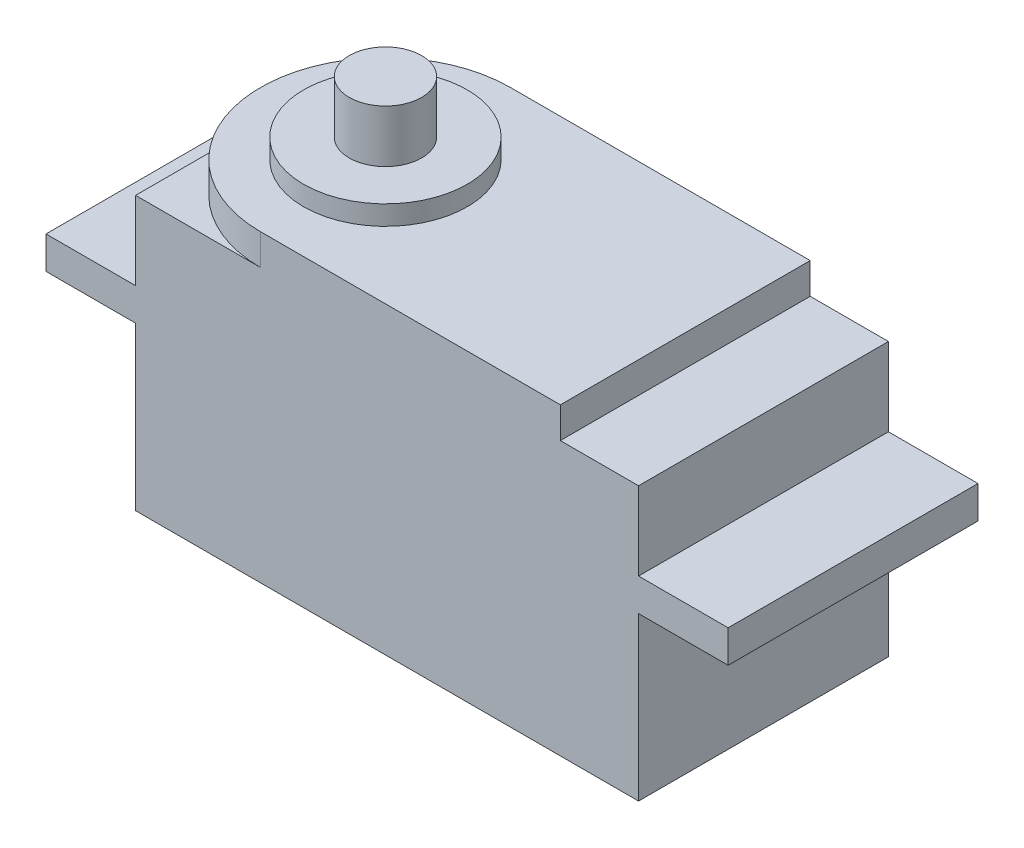
ISO-10303-21;
HEADER;
FILE_DESCRIPTION(('STEP AP214'),'2;1');
FILE_NAME('part.step','',(''),(''),'','','');
FILE_SCHEMA(('AUTOMOTIVE_DESIGN { 1 0 10303 214 1 1 1 1 }'));
ENDSEC;
DATA;
#1=APPLICATION_CONTEXT('core data for automotive mechanical design processes');
#2=APPLICATION_PROTOCOL_DEFINITION('international standard','automotive_design',2000,#1);
#3=PRODUCT_CONTEXT('',#1,'mechanical');
#4=PRODUCT('Part','Part','',(#3));
#5=PRODUCT_RELATED_PRODUCT_CATEGORY('part','',(#4));
#6=PRODUCT_DEFINITION_FORMATION('','',#4);
#7=PRODUCT_DEFINITION_CONTEXT('part definition',#1,'design');
#8=PRODUCT_DEFINITION('design','',#6,#7);
#9=PRODUCT_DEFINITION_SHAPE('','',#8);
#10=(LENGTH_UNIT() NAMED_UNIT(*) SI_UNIT(.MILLI.,.METRE.));
#11=(NAMED_UNIT(*) PLANE_ANGLE_UNIT() SI_UNIT($,.RADIAN.));
#12=(NAMED_UNIT(*) SI_UNIT($,.STERADIAN.) SOLID_ANGLE_UNIT());
#13=UNCERTAINTY_MEASURE_WITH_UNIT(LENGTH_MEASURE(1.E-05),#10,'distance_accuracy_value','');
#14=(GEOMETRIC_REPRESENTATION_CONTEXT(3) GLOBAL_UNCERTAINTY_ASSIGNED_CONTEXT((#13)) GLOBAL_UNIT_ASSIGNED_CONTEXT((#10,
#11,#12)) REPRESENTATION_CONTEXT('',''));
#15=CARTESIAN_POINT('',(0.,0.,0.));
#16=DIRECTION('',(0.,0.,1.));
#17=DIRECTION('',(1.,0.,0.));
#18=AXIS2_PLACEMENT_3D('',#15,#16,#17);
#19=CARTESIAN_POINT('',(-20.13,36.86,10.));
#20=DIRECTION('',(1.,0.,0.));
#21=DIRECTION('',(0.,0.,-1.));
#22=AXIS2_PLACEMENT_3D('',#19,#20,#21);
#23=PLANE('',#22);
#24=DIRECTION('',(0.,0.,-1.));
#25=VECTOR('',#24,1.);
#26=CARTESIAN_POINT('',(-20.13,15.,10.));
#27=LINE('',#26,#25);
#28=CARTESIAN_POINT('',(-20.13,15.,10.));
#29=VERTEX_POINT('',#28);
#30=CARTESIAN_POINT('',(-20.13,15.,-10.));
#31=VERTEX_POINT('',#30);
#32=EDGE_CURVE('E156',#29,#31,#27,.T.);
#33=ORIENTED_EDGE('',*,*,#32,.F.);
#34=DIRECTION('',(0.,-1.,0.));
#35=VECTOR('',#34,1.);
#36=CARTESIAN_POINT('',(-20.13,36.86,10.));
#37=LINE('',#36,#35);
#38=CARTESIAN_POINT('',(-20.13,28.,10.));
#39=VERTEX_POINT('',#38);
#40=EDGE_CURVE('E196',#39,#29,#37,.T.);
#41=ORIENTED_EDGE('',*,*,#40,.F.);
#42=DIRECTION('',(0.,0.,1.));
#43=VECTOR('',#42,1.);
#44=CARTESIAN_POINT('',(-20.13,28.,-10.));
#45=LINE('',#44,#43);
#46=CARTESIAN_POINT('',(-20.13,28.,-10.));
#47=VERTEX_POINT('',#46);
#48=EDGE_CURVE('E253',#47,#39,#45,.T.);
#49=ORIENTED_EDGE('',*,*,#48,.F.);
#50=DIRECTION('',(0.,-1.,0.));
#51=VECTOR('',#50,1.);
#52=CARTESIAN_POINT('',(-20.13,36.86,-10.));
#53=LINE('',#52,#51);
#54=EDGE_CURVE('E179',#47,#31,#53,.T.);
#55=ORIENTED_EDGE('',*,*,#54,.T.);
#56=EDGE_LOOP('',(#33,#41,#49,#55));
#57=FACE_BOUND('',#56,.T.);
#58=ADVANCED_FACE('F36',(#57),#23,.F.);
#59=CARTESIAN_POINT('',(20.13,36.86,10.));
#60=DIRECTION('',(-1.,0.,0.));
#61=DIRECTION('',(0.,0.,1.));
#62=AXIS2_PLACEMENT_3D('',#59,#60,#61);
#63=PLANE('',#62);
#64=DIRECTION('',(0.,0.,1.));
#65=VECTOR('',#64,1.);
#66=CARTESIAN_POINT('',(20.13,15.,-10.));
#67=LINE('',#66,#65);
#68=CARTESIAN_POINT('',(20.13,15.,-10.));
#69=VERTEX_POINT('',#68);
#70=CARTESIAN_POINT('',(20.13,15.,10.));
#71=VERTEX_POINT('',#70);
#72=EDGE_CURVE('E53',#69,#71,#67,.T.);
#73=ORIENTED_EDGE('',*,*,#72,.F.);
#74=DIRECTION('',(0.,-1.,0.));
#75=VECTOR('',#74,1.);
#76=CARTESIAN_POINT('',(20.13,36.86,-10.));
#77=LINE('',#76,#75);
#78=CARTESIAN_POINT('',(20.13,28.,-10.));
#79=VERTEX_POINT('',#78);
#80=EDGE_CURVE('E164',#79,#69,#77,.T.);
#81=ORIENTED_EDGE('',*,*,#80,.F.);
#82=DIRECTION('',(0.,0.,-1.));
#83=VECTOR('',#82,1.);
#84=CARTESIAN_POINT('',(20.13,28.,10.));
#85=LINE('',#84,#83);
#86=CARTESIAN_POINT('',(20.13,28.,10.));
#87=VERTEX_POINT('',#86);
#88=EDGE_CURVE('E212',#87,#79,#85,.T.);
#89=ORIENTED_EDGE('',*,*,#88,.F.);
#90=DIRECTION('',(0.,-1.,0.));
#91=VECTOR('',#90,1.);
#92=CARTESIAN_POINT('',(20.13,36.86,10.));
#93=LINE('',#92,#91);
#94=EDGE_CURVE('E167',#87,#71,#93,.T.);
#95=ORIENTED_EDGE('',*,*,#94,.T.);
#96=EDGE_LOOP('',(#73,#81,#89,#95));
#97=FACE_BOUND('',#96,.T.);
#98=ADVANCED_FACE('F38',(#97),#63,.F.);
#99=CARTESIAN_POINT('',(-20.13,36.86,-10.));
#100=DIRECTION('',(0.,0.,1.));
#101=DIRECTION('',(1.,0.,0.));
#102=AXIS2_PLACEMENT_3D('',#99,#100,#101);
#103=PLANE('',#102);
#104=DIRECTION('',(1.,0.,0.));
#105=VECTOR('',#104,1.);
#106=CARTESIAN_POINT('',(-20.13,15.,-10.));
#107=LINE('',#106,#105);
#108=EDGE_CURVE('E153',#31,#69,#107,.T.);
#109=ORIENTED_EDGE('',*,*,#108,.F.);
#110=ORIENTED_EDGE('',*,*,#54,.F.);
#111=DIRECTION('',(1.,0.,0.));
#112=VECTOR('',#111,1.);
#113=CARTESIAN_POINT('',(-27.3,28.,-10.));
#114=LINE('',#113,#112);
#115=CARTESIAN_POINT('',(-27.3,28.,-10.));
#116=VERTEX_POINT('',#115);
#117=EDGE_CURVE('E243',#116,#47,#114,.T.);
#118=ORIENTED_EDGE('',*,*,#117,.F.);
#119=DIRECTION('',(0.,-1.,0.));
#120=VECTOR('',#119,1.);
#121=CARTESIAN_POINT('',(-27.3,28.,-10.));
#122=LINE('',#121,#120);
#123=CARTESIAN_POINT('',(-27.3,30.6,-10.));
#124=VERTEX_POINT('',#123);
#125=EDGE_CURVE('E380',#124,#116,#122,.T.);
#126=ORIENTED_EDGE('',*,*,#125,.F.);
#127=DIRECTION('',(1.,0.,0.));
#128=VECTOR('',#127,1.);
#129=CARTESIAN_POINT('',(-27.3,30.6,-10.));
#130=LINE('',#129,#128);
#131=CARTESIAN_POINT('',(-20.13,30.6,-10.));
#132=VERTEX_POINT('',#131);
#133=EDGE_CURVE('E246',#124,#132,#130,.T.);
#134=ORIENTED_EDGE('',*,*,#133,.T.);
#135=CARTESIAN_POINT('',(-20.13,36.86,-10.));
#136=VERTEX_POINT('',#135);
#137=EDGE_CURVE('E175',#136,#132,#53,.T.);
#138=ORIENTED_EDGE('',*,*,#137,.F.);
#139=DIRECTION('',(-1.,0.,0.));
#140=VECTOR('',#139,1.);
#141=CARTESIAN_POINT('',(-20.13,36.86,-10.));
#142=LINE('',#141,#140);
#143=CARTESIAN_POINT('',(-10.13,36.86,-10.));
#144=VERTEX_POINT('',#143);
#145=EDGE_CURVE('E227',#144,#136,#142,.T.);
#146=ORIENTED_EDGE('',*,*,#145,.F.);
#147=DIRECTION('',(0.,-1.,0.));
#148=VECTOR('',#147,1.);
#149=CARTESIAN_POINT('',(-10.13,39.34,-10.));
#150=LINE('',#149,#148);
#151=CARTESIAN_POINT('',(-10.13,39.34,-10.));
#152=VERTEX_POINT('',#151);
#153=EDGE_CURVE('E348',#152,#144,#150,.T.);
#154=ORIENTED_EDGE('',*,*,#153,.F.);
#155=DIRECTION('',(-1.,0.,0.));
#156=VECTOR('',#155,1.);
#157=CARTESIAN_POINT('',(0.,39.34,-10.));
#158=LINE('',#157,#156);
#159=CARTESIAN_POINT('',(13.87,39.34,-10.));
#160=VERTEX_POINT('',#159);
#161=EDGE_CURVE('E337',#160,#152,#158,.T.);
#162=ORIENTED_EDGE('',*,*,#161,.F.);
#163=DIRECTION('',(0.,-1.,0.));
#164=VECTOR('',#163,1.);
#165=CARTESIAN_POINT('',(13.87,39.34,-10.));
#166=LINE('',#165,#164);
#167=CARTESIAN_POINT('',(13.87,36.86,-10.));
#168=VERTEX_POINT('',#167);
#169=EDGE_CURVE('E324',#160,#168,#166,.T.);
#170=ORIENTED_EDGE('',*,*,#169,.T.);
#171=CARTESIAN_POINT('',(20.13,36.86,-10.));
#172=VERTEX_POINT('',#171);
#173=EDGE_CURVE('E237',#172,#168,#142,.T.);
#174=ORIENTED_EDGE('',*,*,#173,.F.);
#175=CARTESIAN_POINT('',(20.13,30.6,-10.));
#176=VERTEX_POINT('',#175);
#177=EDGE_CURVE('E45',#172,#176,#77,.T.);
#178=ORIENTED_EDGE('',*,*,#177,.T.);
#179=DIRECTION('',(-1.,0.,0.));
#180=VECTOR('',#179,1.);
#181=CARTESIAN_POINT('',(27.3,30.6,-10.));
#182=LINE('',#181,#180);
#183=CARTESIAN_POINT('',(27.3,30.6,-10.));
#184=VERTEX_POINT('',#183);
#185=EDGE_CURVE('E228',#184,#176,#182,.T.);
#186=ORIENTED_EDGE('',*,*,#185,.F.);
#187=DIRECTION('',(0.,1.,0.));
#188=VECTOR('',#187,1.);
#189=CARTESIAN_POINT('',(27.3,28.,-10.));
#190=LINE('',#189,#188);
#191=CARTESIAN_POINT('',(27.3,28.,-10.));
#192=VERTEX_POINT('',#191);
#193=EDGE_CURVE('E215',#192,#184,#190,.T.);
#194=ORIENTED_EDGE('',*,*,#193,.F.);
#195=DIRECTION('',(-1.,0.,0.));
#196=VECTOR('',#195,1.);
#197=CARTESIAN_POINT('',(27.3,28.,-10.));
#198=LINE('',#197,#196);
#199=EDGE_CURVE('E174',#192,#79,#198,.T.);
#200=ORIENTED_EDGE('',*,*,#199,.T.);
#201=ORIENTED_EDGE('',*,*,#80,.T.);
#202=EDGE_LOOP('',(#109,#110,#118,#126,#134,#138,#146,#154,#162,#170,#174,#178,#186,#194,#200,#201));
#203=FACE_BOUND('',#202,.T.);
#204=ADVANCED_FACE('F171',(#203),#103,.F.);
#205=CARTESIAN_POINT('',(-20.13,36.86,10.));
#206=DIRECTION('',(0.,0.,-1.));
#207=DIRECTION('',(-1.,0.,0.));
#208=AXIS2_PLACEMENT_3D('',#205,#206,#207);
#209=PLANE('',#208);
#210=DIRECTION('',(-1.,0.,0.));
#211=VECTOR('',#210,1.);
#212=CARTESIAN_POINT('',(20.13,15.,10.));
#213=LINE('',#212,#211);
#214=EDGE_CURVE('E168',#71,#29,#213,.T.);
#215=ORIENTED_EDGE('',*,*,#214,.F.);
#216=ORIENTED_EDGE('',*,*,#94,.F.);
#217=DIRECTION('',(-1.,0.,0.));
#218=VECTOR('',#217,1.);
#219=CARTESIAN_POINT('',(27.3,28.,10.));
#220=LINE('',#219,#218);
#221=CARTESIAN_POINT('',(27.3,28.,10.));
#222=VERTEX_POINT('',#221);
#223=EDGE_CURVE('E204',#222,#87,#220,.T.);
#224=ORIENTED_EDGE('',*,*,#223,.F.);
#225=DIRECTION('',(0.,-1.,0.));
#226=VECTOR('',#225,1.);
#227=CARTESIAN_POINT('',(27.3,28.,10.));
#228=LINE('',#227,#226);
#229=CARTESIAN_POINT('',(27.3,30.6,10.));
#230=VERTEX_POINT('',#229);
#231=EDGE_CURVE('E270',#230,#222,#228,.T.);
#232=ORIENTED_EDGE('',*,*,#231,.F.);
#233=DIRECTION('',(-1.,0.,0.));
#234=VECTOR('',#233,1.);
#235=CARTESIAN_POINT('',(27.3,30.6,10.));
#236=LINE('',#235,#234);
#237=CARTESIAN_POINT('',(20.13,30.6,10.));
#238=VERTEX_POINT('',#237);
#239=EDGE_CURVE('E207',#230,#238,#236,.T.);
#240=ORIENTED_EDGE('',*,*,#239,.T.);
#241=CARTESIAN_POINT('',(20.13,36.86,10.));
#242=VERTEX_POINT('',#241);
#243=EDGE_CURVE('E183',#242,#238,#93,.T.);
#244=ORIENTED_EDGE('',*,*,#243,.F.);
#245=DIRECTION('',(1.,0.,0.));
#246=VECTOR('',#245,1.);
#247=CARTESIAN_POINT('',(-20.13,36.86,10.));
#248=LINE('',#247,#246);
#249=CARTESIAN_POINT('',(13.87,36.86,10.));
#250=VERTEX_POINT('',#249);
#251=EDGE_CURVE('E295',#250,#242,#248,.T.);
#252=ORIENTED_EDGE('',*,*,#251,.F.);
#253=DIRECTION('',(0.,-1.,0.));
#254=VECTOR('',#253,1.);
#255=CARTESIAN_POINT('',(13.87,39.34,10.));
#256=LINE('',#255,#254);
#257=CARTESIAN_POINT('',(13.87,39.34,10.));
#258=VERTEX_POINT('',#257);
#259=EDGE_CURVE('E61',#258,#250,#256,.T.);
#260=ORIENTED_EDGE('',*,*,#259,.F.);
#261=DIRECTION('',(1.,0.,0.));
#262=VECTOR('',#261,1.);
#263=CARTESIAN_POINT('',(0.,39.34,10.));
#264=LINE('',#263,#262);
#265=CARTESIAN_POINT('',(-10.13,39.34,10.));
#266=VERTEX_POINT('',#265);
#267=EDGE_CURVE('E320',#266,#258,#264,.T.);
#268=ORIENTED_EDGE('',*,*,#267,.F.);
#269=DIRECTION('',(0.,-1.,0.));
#270=VECTOR('',#269,1.);
#271=CARTESIAN_POINT('',(-10.13,39.34,10.));
#272=LINE('',#271,#270);
#273=CARTESIAN_POINT('',(-10.13,36.86,10.));
#274=VERTEX_POINT('',#273);
#275=EDGE_CURVE('E319',#266,#274,#272,.T.);
#276=ORIENTED_EDGE('',*,*,#275,.T.);
#277=CARTESIAN_POINT('',(-20.13,36.86,10.));
#278=VERTEX_POINT('',#277);
#279=EDGE_CURVE('E289',#278,#274,#248,.T.);
#280=ORIENTED_EDGE('',*,*,#279,.F.);
#281=CARTESIAN_POINT('',(-20.13,30.6,10.));
#282=VERTEX_POINT('',#281);
#283=EDGE_CURVE('E199',#278,#282,#37,.T.);
#284=ORIENTED_EDGE('',*,*,#283,.T.);
#285=DIRECTION('',(1.,0.,0.));
#286=VECTOR('',#285,1.);
#287=CARTESIAN_POINT('',(-27.3,30.6,10.));
#288=LINE('',#287,#286);
#289=CARTESIAN_POINT('',(-27.3,30.6,10.));
#290=VERTEX_POINT('',#289);
#291=EDGE_CURVE('E288',#290,#282,#288,.T.);
#292=ORIENTED_EDGE('',*,*,#291,.F.);
#293=DIRECTION('',(0.,1.,0.));
#294=VECTOR('',#293,1.);
#295=CARTESIAN_POINT('',(-27.3,28.,10.));
#296=LINE('',#295,#294);
#297=CARTESIAN_POINT('',(-27.3,28.,10.));
#298=VERTEX_POINT('',#297);
#299=EDGE_CURVE('E257',#298,#290,#296,.T.);
#300=ORIENTED_EDGE('',*,*,#299,.F.);
#301=DIRECTION('',(1.,0.,0.));
#302=VECTOR('',#301,1.);
#303=CARTESIAN_POINT('',(-27.3,28.,10.));
#304=LINE('',#303,#302);
#305=EDGE_CURVE('E247',#298,#39,#304,.T.);
#306=ORIENTED_EDGE('',*,*,#305,.T.);
#307=ORIENTED_EDGE('',*,*,#40,.T.);
#308=EDGE_LOOP('',(#215,#216,#224,#232,#240,#244,#252,#260,#268,#276,#280,#284,#292,#300,#306,#307));
#309=FACE_BOUND('',#308,.T.);
#310=ADVANCED_FACE('F317',(#309),#209,.F.);
#311=CARTESIAN_POINT('',(-10.13,40.9,0.));
#312=DIRECTION('',(0.,1.,0.));
#313=DIRECTION('',(0.,0.,1.));
#314=AXIS2_PLACEMENT_3D('',#311,#312,#313);
#315=PLANE('',#314);
#316=CARTESIAN_POINT('',(-10.13,40.9,0.));
#317=DIRECTION('',(0.,1.,0.));
#318=DIRECTION('',(0.,0.,1.));
#319=AXIS2_PLACEMENT_3D('',#316,#317,#318);
#320=CIRCLE('',#319,6.55);
#321=CARTESIAN_POINT('',(-10.13,40.9,6.55));
#322=VERTEX_POINT('',#321);
#323=EDGE_CURVE('E331',#322,#322,#320,.T.);
#324=ORIENTED_EDGE('',*,*,#323,.T.);
#325=EDGE_LOOP('',(#324));
#326=FACE_BOUND('',#325,.T.);
#327=CARTESIAN_POINT('',(-10.13,40.9,0.));
#328=DIRECTION('',(0.,1.,0.));
#329=DIRECTION('',(0.,0.,1.));
#330=AXIS2_PLACEMENT_3D('',#327,#328,#329);
#331=CIRCLE('',#330,2.9);
#332=CARTESIAN_POINT('',(-10.13,40.9,2.9));
#333=VERTEX_POINT('',#332);
#334=EDGE_CURVE('E364',#333,#333,#331,.T.);
#335=ORIENTED_EDGE('',*,*,#334,.F.);
#336=EDGE_LOOP('',(#335));
#337=FACE_BOUND('',#336,.T.);
#338=ADVANCED_FACE('F523',(#326,#337),#315,.T.);
#339=CARTESIAN_POINT('',(0.,39.34,0.));
#340=DIRECTION('',(0.,1.,0.));
#341=DIRECTION('',(0.,0.,1.));
#342=AXIS2_PLACEMENT_3D('',#339,#340,#341);
#343=PLANE('',#342);
#344=CARTESIAN_POINT('',(-10.13,39.34,0.));
#345=DIRECTION('',(0.,1.,0.));
#346=DIRECTION('',(0.,0.,1.));
#347=AXIS2_PLACEMENT_3D('',#344,#345,#346);
#348=CIRCLE('',#347,10.);
#349=EDGE_CURVE('E343',#152,#266,#348,.T.);
#350=ORIENTED_EDGE('',*,*,#349,.T.);
#351=ORIENTED_EDGE('',*,*,#267,.T.);
#352=DIRECTION('',(0.,0.,1.));
#353=VECTOR('',#352,1.);
#354=CARTESIAN_POINT('',(13.87,39.34,0.));
#355=LINE('',#354,#353);
#356=EDGE_CURVE('E351',#160,#258,#355,.T.);
#357=ORIENTED_EDGE('',*,*,#356,.F.);
#358=ORIENTED_EDGE('',*,*,#161,.T.);
#359=EDGE_LOOP('',(#350,#351,#357,#358));
#360=FACE_BOUND('',#359,.T.);
#361=CARTESIAN_POINT('',(-10.13,39.34,0.));
#362=DIRECTION('',(0.,1.,0.));
#363=DIRECTION('',(0.,0.,1.));
#364=AXIS2_PLACEMENT_3D('',#361,#362,#363);
#365=CIRCLE('',#364,6.55);
#366=CARTESIAN_POINT('',(-10.13,39.34,6.55));
#367=VERTEX_POINT('',#366);
#368=EDGE_CURVE('E358',#367,#367,#365,.T.);
#369=ORIENTED_EDGE('',*,*,#368,.F.);
#370=EDGE_LOOP('',(#369));
#371=FACE_BOUND('',#370,.T.);
#372=ADVANCED_FACE('F420',(#360,#371),#343,.T.);
#373=CARTESIAN_POINT('',(0.,36.86,0.));
#374=DIRECTION('',(0.,-1.,0.));
#375=DIRECTION('',(0.,0.,-1.));
#376=AXIS2_PLACEMENT_3D('',#373,#374,#375);
#377=PLANE('',#376);
#378=CARTESIAN_POINT('',(-10.13,36.86,0.));
#379=DIRECTION('',(0.,1.,0.));
#380=DIRECTION('',(0.,0.,1.));
#381=AXIS2_PLACEMENT_3D('',#378,#379,#380);
#382=CIRCLE('',#381,10.);
#383=CARTESIAN_POINT('',(-20.13,36.86,0.));
#384=VERTEX_POINT('',#383);
#385=EDGE_CURVE('E327',#144,#384,#382,.T.);
#386=ORIENTED_EDGE('',*,*,#385,.F.);
#387=ORIENTED_EDGE('',*,*,#145,.T.);
#388=DIRECTION('',(0.,0.,1.));
#389=VECTOR('',#388,1.);
#390=CARTESIAN_POINT('',(-20.13,36.86,10.));
#391=LINE('',#390,#389);
#392=EDGE_CURVE('E231',#136,#384,#391,.T.);
#393=ORIENTED_EDGE('',*,*,#392,.T.);
#394=EDGE_LOOP('',(#386,#387,#393));
#395=FACE_BOUND('',#394,.T.);
#396=ADVANCED_FACE('F415',(#395),#377,.F.);
#397=EDGE_CURVE('E11',#384,#274,#382,.T.);
#398=ORIENTED_EDGE('',*,*,#397,.F.);
#399=EDGE_CURVE('E240',#384,#278,#391,.T.);
#400=ORIENTED_EDGE('',*,*,#399,.T.);
#401=ORIENTED_EDGE('',*,*,#279,.T.);
#402=EDGE_LOOP('',(#398,#400,#401));
#403=FACE_BOUND('',#402,.T.);
#404=ADVANCED_FACE('F309',(#403),#377,.F.);
#405=DIRECTION('',(0.,0.,-1.));
#406=VECTOR('',#405,1.);
#407=CARTESIAN_POINT('',(-20.13,30.6,-10.));
#408=LINE('',#407,#406);
#409=EDGE_CURVE('E258',#282,#132,#408,.T.);
#410=ORIENTED_EDGE('',*,*,#409,.F.);
#411=ORIENTED_EDGE('',*,*,#283,.F.);
#412=ORIENTED_EDGE('',*,*,#399,.F.);
#413=ORIENTED_EDGE('',*,*,#392,.F.);
#414=ORIENTED_EDGE('',*,*,#137,.T.);
#415=EDGE_LOOP('',(#410,#411,#412,#413,#414));
#416=FACE_BOUND('',#415,.T.);
#417=ADVANCED_FACE('F311',(#416),#23,.F.);
#418=DIRECTION('',(0.,0.,1.));
#419=VECTOR('',#418,1.);
#420=CARTESIAN_POINT('',(20.13,30.6,10.));
#421=LINE('',#420,#419);
#422=EDGE_CURVE('E216',#176,#238,#421,.T.);
#423=ORIENTED_EDGE('',*,*,#422,.F.);
#424=ORIENTED_EDGE('',*,*,#177,.F.);
#425=DIRECTION('',(0.,0.,-1.));
#426=VECTOR('',#425,1.);
#427=CARTESIAN_POINT('',(20.13,36.86,10.));
#428=LINE('',#427,#426);
#429=EDGE_CURVE('E224',#242,#172,#428,.T.);
#430=ORIENTED_EDGE('',*,*,#429,.F.);
#431=ORIENTED_EDGE('',*,*,#243,.T.);
#432=EDGE_LOOP('',(#423,#424,#430,#431));
#433=FACE_BOUND('',#432,.T.);
#434=ADVANCED_FACE('F406',(#433),#63,.F.);
#435=ORIENTED_EDGE('',*,*,#173,.T.);
#436=DIRECTION('',(0.,0.,1.));
#437=VECTOR('',#436,1.);
#438=CARTESIAN_POINT('',(13.87,36.86,0.));
#439=LINE('',#438,#437);
#440=EDGE_CURVE('E330',#168,#250,#439,.T.);
#441=ORIENTED_EDGE('',*,*,#440,.T.);
#442=ORIENTED_EDGE('',*,*,#251,.T.);
#443=ORIENTED_EDGE('',*,*,#429,.T.);
#444=EDGE_LOOP('',(#435,#441,#442,#443));
#445=FACE_BOUND('',#444,.T.);
#446=ADVANCED_FACE('F413',(#445),#377,.F.);
#447=CARTESIAN_POINT('',(27.3,30.6,10.));
#448=DIRECTION('',(0.,-1.,0.));
#449=DIRECTION('',(0.,0.,-1.));
#450=AXIS2_PLACEMENT_3D('',#447,#448,#449);
#451=PLANE('',#450);
#452=ORIENTED_EDGE('',*,*,#422,.T.);
#453=ORIENTED_EDGE('',*,*,#239,.F.);
#454=DIRECTION('',(0.,0.,1.));
#455=VECTOR('',#454,1.);
#456=CARTESIAN_POINT('',(27.3,30.6,10.));
#457=LINE('',#456,#455);
#458=EDGE_CURVE('E268',#184,#230,#457,.T.);
#459=ORIENTED_EDGE('',*,*,#458,.F.);
#460=ORIENTED_EDGE('',*,*,#185,.T.);
#461=EDGE_LOOP('',(#452,#453,#459,#460));
#462=FACE_BOUND('',#461,.T.);
#463=ADVANCED_FACE('F423',(#462),#451,.F.);
#464=CARTESIAN_POINT('',(27.3,28.,10.));
#465=DIRECTION('',(0.,1.,0.));
#466=DIRECTION('',(0.,0.,1.));
#467=AXIS2_PLACEMENT_3D('',#464,#465,#466);
#468=PLANE('',#467);
#469=ORIENTED_EDGE('',*,*,#88,.T.);
#470=ORIENTED_EDGE('',*,*,#199,.F.);
#471=DIRECTION('',(0.,0.,-1.));
#472=VECTOR('',#471,1.);
#473=CARTESIAN_POINT('',(27.3,28.,10.));
#474=LINE('',#473,#472);
#475=EDGE_CURVE('E211',#222,#192,#474,.T.);
#476=ORIENTED_EDGE('',*,*,#475,.F.);
#477=ORIENTED_EDGE('',*,*,#223,.T.);
#478=EDGE_LOOP('',(#469,#470,#476,#477));
#479=FACE_BOUND('',#478,.T.);
#480=ADVANCED_FACE('F278',(#479),#468,.F.);
#481=CARTESIAN_POINT('',(27.3,0.,0.));
#482=DIRECTION('',(-1.,0.,0.));
#483=DIRECTION('',(0.,0.,1.));
#484=AXIS2_PLACEMENT_3D('',#481,#482,#483);
#485=PLANE('',#484);
#486=ORIENTED_EDGE('',*,*,#193,.T.);
#487=ORIENTED_EDGE('',*,*,#458,.T.);
#488=ORIENTED_EDGE('',*,*,#231,.T.);
#489=ORIENTED_EDGE('',*,*,#475,.T.);
#490=EDGE_LOOP('',(#486,#487,#488,#489));
#491=FACE_BOUND('',#490,.T.);
#492=ADVANCED_FACE('F273',(#491),#485,.F.);
#493=CARTESIAN_POINT('',(-27.3,30.6,-10.));
#494=DIRECTION('',(0.,-1.,0.));
#495=DIRECTION('',(0.,0.,-1.));
#496=AXIS2_PLACEMENT_3D('',#493,#494,#495);
#497=PLANE('',#496);
#498=ORIENTED_EDGE('',*,*,#409,.T.);
#499=ORIENTED_EDGE('',*,*,#133,.F.);
#500=DIRECTION('',(0.,0.,-1.));
#501=VECTOR('',#500,1.);
#502=CARTESIAN_POINT('',(-27.3,30.6,-10.));
#503=LINE('',#502,#501);
#504=EDGE_CURVE('E384',#290,#124,#503,.T.);
#505=ORIENTED_EDGE('',*,*,#504,.F.);
#506=ORIENTED_EDGE('',*,*,#291,.T.);
#507=EDGE_LOOP('',(#498,#499,#505,#506));
#508=FACE_BOUND('',#507,.T.);
#509=ADVANCED_FACE('F392',(#508),#497,.F.);
#510=CARTESIAN_POINT('',(-27.3,28.,-10.));
#511=DIRECTION('',(0.,1.,0.));
#512=DIRECTION('',(0.,0.,1.));
#513=AXIS2_PLACEMENT_3D('',#510,#511,#512);
#514=PLANE('',#513);
#515=ORIENTED_EDGE('',*,*,#48,.T.);
#516=ORIENTED_EDGE('',*,*,#305,.F.);
#517=DIRECTION('',(0.,0.,1.));
#518=VECTOR('',#517,1.);
#519=CARTESIAN_POINT('',(-27.3,28.,-10.));
#520=LINE('',#519,#518);
#521=EDGE_CURVE('E252',#116,#298,#520,.T.);
#522=ORIENTED_EDGE('',*,*,#521,.F.);
#523=ORIENTED_EDGE('',*,*,#117,.T.);
#524=EDGE_LOOP('',(#515,#516,#522,#523));
#525=FACE_BOUND('',#524,.T.);
#526=ADVANCED_FACE('F376',(#525),#514,.F.);
#527=CARTESIAN_POINT('',(-27.3,0.,0.));
#528=DIRECTION('',(1.,0.,0.));
#529=DIRECTION('',(0.,0.,-1.));
#530=AXIS2_PLACEMENT_3D('',#527,#528,#529);
#531=PLANE('',#530);
#532=ORIENTED_EDGE('',*,*,#299,.T.);
#533=ORIENTED_EDGE('',*,*,#504,.T.);
#534=ORIENTED_EDGE('',*,*,#125,.T.);
#535=ORIENTED_EDGE('',*,*,#521,.T.);
#536=EDGE_LOOP('',(#532,#533,#534,#535));
#537=FACE_BOUND('',#536,.T.);
#538=ADVANCED_FACE('F387',(#537),#531,.F.);
#539=CARTESIAN_POINT('',(-10.13,39.34,0.));
#540=DIRECTION('',(0.,-1.,0.));
#541=DIRECTION('',(0.,0.,-1.));
#542=AXIS2_PLACEMENT_3D('',#539,#540,#541);
#543=CYLINDRICAL_SURFACE('',#542,10.);
#544=ORIENTED_EDGE('',*,*,#385,.T.);
#545=ORIENTED_EDGE('',*,*,#397,.T.);
#546=ORIENTED_EDGE('',*,*,#275,.F.);
#547=ORIENTED_EDGE('',*,*,#349,.F.);
#548=ORIENTED_EDGE('',*,*,#153,.T.);
#549=EDGE_LOOP('',(#544,#545,#546,#547,#548));
#550=FACE_BOUND('',#549,.T.);
#551=ADVANCED_FACE('F431',(#550),#543,.T.);
#552=CARTESIAN_POINT('',(13.87,39.34,0.));
#553=DIRECTION('',(1.,0.,0.));
#554=DIRECTION('',(0.,0.,-1.));
#555=AXIS2_PLACEMENT_3D('',#552,#553,#554);
#556=PLANE('',#555);
#557=ORIENTED_EDGE('',*,*,#440,.F.);
#558=ORIENTED_EDGE('',*,*,#169,.F.);
#559=ORIENTED_EDGE('',*,*,#356,.T.);
#560=ORIENTED_EDGE('',*,*,#259,.T.);
#561=EDGE_LOOP('',(#557,#558,#559,#560));
#562=FACE_BOUND('',#561,.T.);
#563=ADVANCED_FACE('F428',(#562),#556,.T.);
#564=CARTESIAN_POINT('',(-10.13,40.9,0.));
#565=DIRECTION('',(0.,-1.,0.));
#566=DIRECTION('',(0.,0.,-1.));
#567=AXIS2_PLACEMENT_3D('',#564,#565,#566);
#568=CYLINDRICAL_SURFACE('',#567,6.55);
#569=ORIENTED_EDGE('',*,*,#323,.F.);
#570=EDGE_LOOP('',(#569));
#571=FACE_BOUND('',#570,.T.);
#572=ORIENTED_EDGE('',*,*,#368,.T.);
#573=EDGE_LOOP('',(#572));
#574=FACE_BOUND('',#573,.T.);
#575=ADVANCED_FACE('F430',(#571,#574),#568,.T.);
#576=CARTESIAN_POINT('',(-10.13,45.1,0.));
#577=DIRECTION('',(0.,-1.,0.));
#578=DIRECTION('',(0.,0.,-1.));
#579=AXIS2_PLACEMENT_3D('',#576,#577,#578);
#580=CYLINDRICAL_SURFACE('',#579,2.9);
#581=CARTESIAN_POINT('',(-10.13,45.1,0.));
#582=DIRECTION('',(0.,1.,0.));
#583=DIRECTION('',(0.,0.,1.));
#584=AXIS2_PLACEMENT_3D('',#581,#582,#583);
#585=CIRCLE('',#584,2.9);
#586=CARTESIAN_POINT('',(-10.13,45.1,2.9));
#587=VERTEX_POINT('',#586);
#588=EDGE_CURVE('E361',#587,#587,#585,.T.);
#589=ORIENTED_EDGE('',*,*,#588,.F.);
#590=EDGE_LOOP('',(#589));
#591=FACE_BOUND('',#590,.T.);
#592=ORIENTED_EDGE('',*,*,#334,.T.);
#593=EDGE_LOOP('',(#592));
#594=FACE_BOUND('',#593,.T.);
#595=ADVANCED_FACE('F437',(#591,#594),#580,.T.);
#596=CARTESIAN_POINT('',(-10.13,45.1,0.));
#597=DIRECTION('',(0.,1.,0.));
#598=DIRECTION('',(0.,0.,1.));
#599=AXIS2_PLACEMENT_3D('',#596,#597,#598);
#600=PLANE('',#599);
#601=ORIENTED_EDGE('',*,*,#588,.T.);
#602=EDGE_LOOP('',(#601));
#603=FACE_BOUND('',#602,.T.);
#604=ADVANCED_FACE('F475',(#603),#600,.T.);
#605=CARTESIAN_POINT('',(0.,15.,0.));
#606=DIRECTION('',(0.,-1.,0.));
#607=DIRECTION('',(0.,0.,-1.));
#608=AXIS2_PLACEMENT_3D('',#605,#606,#607);
#609=PLANE('',#608);
#610=ORIENTED_EDGE('',*,*,#108,.T.);
#611=ORIENTED_EDGE('',*,*,#72,.T.);
#612=ORIENTED_EDGE('',*,*,#214,.T.);
#613=ORIENTED_EDGE('',*,*,#32,.T.);
#614=EDGE_LOOP('',(#610,#611,#612,#613));
#615=FACE_BOUND('',#614,.T.);
#616=ADVANCED_FACE('F154',(#615),#609,.T.);
#617=CLOSED_SHELL('',(#58,#98,#204,#310,#338,#372,#396,#404,#417,#434,#446,#463,#480,#492,#509,
#526,#538,#551,#563,#575,#595,#604,#616));
#618=MANIFOLD_SOLID_BREP('B2',#617);
#619=ADVANCED_BREP_SHAPE_REPRESENTATION('',(#18,#618),#14);
#620=SHAPE_DEFINITION_REPRESENTATION(#9,#619);
ENDSEC;
END-ISO-10303-21;
